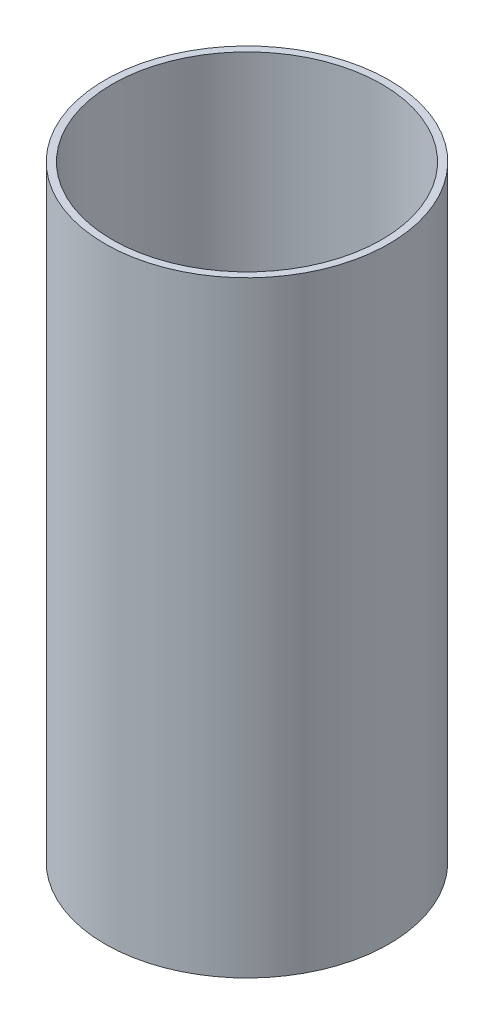
ISO-10303-21;
HEADER;
FILE_DESCRIPTION(('STEP AP214'),'2;1');
FILE_NAME('part.step','',(''),(''),'','','');
FILE_SCHEMA(('AUTOMOTIVE_DESIGN { 1 0 10303 214 1 1 1 1 }'));
ENDSEC;
DATA;
#1=APPLICATION_CONTEXT('core data for automotive mechanical design processes');
#2=APPLICATION_PROTOCOL_DEFINITION('international standard','automotive_design',2000,#1);
#3=PRODUCT_CONTEXT('',#1,'mechanical');
#4=PRODUCT('Part','Part','',(#3));
#5=PRODUCT_RELATED_PRODUCT_CATEGORY('part','',(#4));
#6=PRODUCT_DEFINITION_FORMATION('','',#4);
#7=PRODUCT_DEFINITION_CONTEXT('part definition',#1,'design');
#8=PRODUCT_DEFINITION('design','',#6,#7);
#9=PRODUCT_DEFINITION_SHAPE('','',#8);
#10=(LENGTH_UNIT() NAMED_UNIT(*) SI_UNIT(.MILLI.,.METRE.));
#11=(NAMED_UNIT(*) PLANE_ANGLE_UNIT() SI_UNIT($,.RADIAN.));
#12=(NAMED_UNIT(*) SI_UNIT($,.STERADIAN.) SOLID_ANGLE_UNIT());
#13=UNCERTAINTY_MEASURE_WITH_UNIT(LENGTH_MEASURE(1.E-05),#10,'distance_accuracy_value','');
#14=(GEOMETRIC_REPRESENTATION_CONTEXT(3) GLOBAL_UNCERTAINTY_ASSIGNED_CONTEXT((#13)) GLOBAL_UNIT_ASSIGNED_CONTEXT((#10,
#11,#12)) REPRESENTATION_CONTEXT('',''));
#15=CARTESIAN_POINT('',(0.,0.,0.));
#16=DIRECTION('',(0.,0.,1.));
#17=DIRECTION('',(1.,0.,0.));
#18=AXIS2_PLACEMENT_3D('',#15,#16,#17);
#19=CARTESIAN_POINT('',(0.,200.025,0.));
#20=DIRECTION('',(0.,1.,0.));
#21=DIRECTION('',(0.,0.,1.));
#22=AXIS2_PLACEMENT_3D('',#19,#20,#21);
#23=PLANE('',#22);
#24=CARTESIAN_POINT('',(0.,200.025,0.));
#25=DIRECTION('',(0.,1.,0.));
#26=DIRECTION('',(0.,0.,1.));
#27=AXIS2_PLACEMENT_3D('',#24,#25,#26);
#28=CIRCLE('',#27,93.6625);
#29=CARTESIAN_POINT('',(0.,200.025,93.6625));
#30=VERTEX_POINT('',#29);
#31=EDGE_CURVE('E10',#30,#30,#28,.T.);
#32=ORIENTED_EDGE('',*,*,#31,.T.);
#33=EDGE_LOOP('',(#32));
#34=FACE_BOUND('',#33,.T.);
#35=CARTESIAN_POINT('',(0.,200.025,0.));
#36=DIRECTION('',(0.,1.,0.));
#37=DIRECTION('',(0.,0.,1.));
#38=AXIS2_PLACEMENT_3D('',#35,#36,#37);
#39=CIRCLE('',#38,88.9);
#40=CARTESIAN_POINT('',(0.,200.025,88.9));
#41=VERTEX_POINT('',#40);
#42=EDGE_CURVE('E46',#41,#41,#39,.T.);
#43=ORIENTED_EDGE('',*,*,#42,.F.);
#44=EDGE_LOOP('',(#43));
#45=FACE_BOUND('',#44,.T.);
#46=ADVANCED_FACE('F35',(#34,#45),#23,.T.);
#47=CARTESIAN_POINT('',(0.,-200.025,0.));
#48=DIRECTION('',(0.,1.,0.));
#49=DIRECTION('',(0.,0.,1.));
#50=AXIS2_PLACEMENT_3D('',#47,#48,#49);
#51=PLANE('',#50);
#52=CARTESIAN_POINT('',(0.,-200.025,0.));
#53=DIRECTION('',(0.,1.,0.));
#54=DIRECTION('',(0.,0.,1.));
#55=AXIS2_PLACEMENT_3D('',#52,#53,#54);
#56=CIRCLE('',#55,93.6625);
#57=CARTESIAN_POINT('',(0.,-200.025,93.6625));
#58=VERTEX_POINT('',#57);
#59=EDGE_CURVE('E39',#58,#58,#56,.T.);
#60=ORIENTED_EDGE('',*,*,#59,.F.);
#61=EDGE_LOOP('',(#60));
#62=FACE_BOUND('',#61,.T.);
#63=CARTESIAN_POINT('',(0.,-200.025,0.));
#64=DIRECTION('',(0.,1.,0.));
#65=DIRECTION('',(0.,0.,1.));
#66=AXIS2_PLACEMENT_3D('',#63,#64,#65);
#67=CIRCLE('',#66,88.9);
#68=CARTESIAN_POINT('',(0.,-200.025,88.9));
#69=VERTEX_POINT('',#68);
#70=EDGE_CURVE('E48',#69,#69,#67,.T.);
#71=ORIENTED_EDGE('',*,*,#70,.T.);
#72=EDGE_LOOP('',(#71));
#73=FACE_BOUND('',#72,.T.);
#74=ADVANCED_FACE('F58',(#62,#73),#51,.F.);
#75=CARTESIAN_POINT('',(0.,200.025,0.));
#76=DIRECTION('',(0.,-1.,0.));
#77=DIRECTION('',(0.,0.,-1.));
#78=AXIS2_PLACEMENT_3D('',#75,#76,#77);
#79=CYLINDRICAL_SURFACE('',#78,93.6625);
#80=ORIENTED_EDGE('',*,*,#31,.F.);
#81=EDGE_LOOP('',(#80));
#82=FACE_BOUND('',#81,.T.);
#83=ORIENTED_EDGE('',*,*,#59,.T.);
#84=EDGE_LOOP('',(#83));
#85=FACE_BOUND('',#84,.T.);
#86=ADVANCED_FACE('F37',(#82,#85),#79,.T.);
#87=CARTESIAN_POINT('',(0.,200.025,0.));
#88=DIRECTION('',(0.,-1.,0.));
#89=DIRECTION('',(0.,0.,-1.));
#90=AXIS2_PLACEMENT_3D('',#87,#88,#89);
#91=CYLINDRICAL_SURFACE('',#90,88.9);
#92=ORIENTED_EDGE('',*,*,#42,.T.);
#93=EDGE_LOOP('',(#92));
#94=FACE_BOUND('',#93,.T.);
#95=ORIENTED_EDGE('',*,*,#70,.F.);
#96=EDGE_LOOP('',(#95));
#97=FACE_BOUND('',#96,.T.);
#98=ADVANCED_FACE('F54',(#94,#97),#91,.F.);
#99=CLOSED_SHELL('',(#46,#74,#86,#98));
#100=MANIFOLD_SOLID_BREP('B2',#99);
#101=ADVANCED_BREP_SHAPE_REPRESENTATION('',(#18,#100),#14);
#102=SHAPE_DEFINITION_REPRESENTATION(#9,#101);
ENDSEC;
END-ISO-10303-21;
